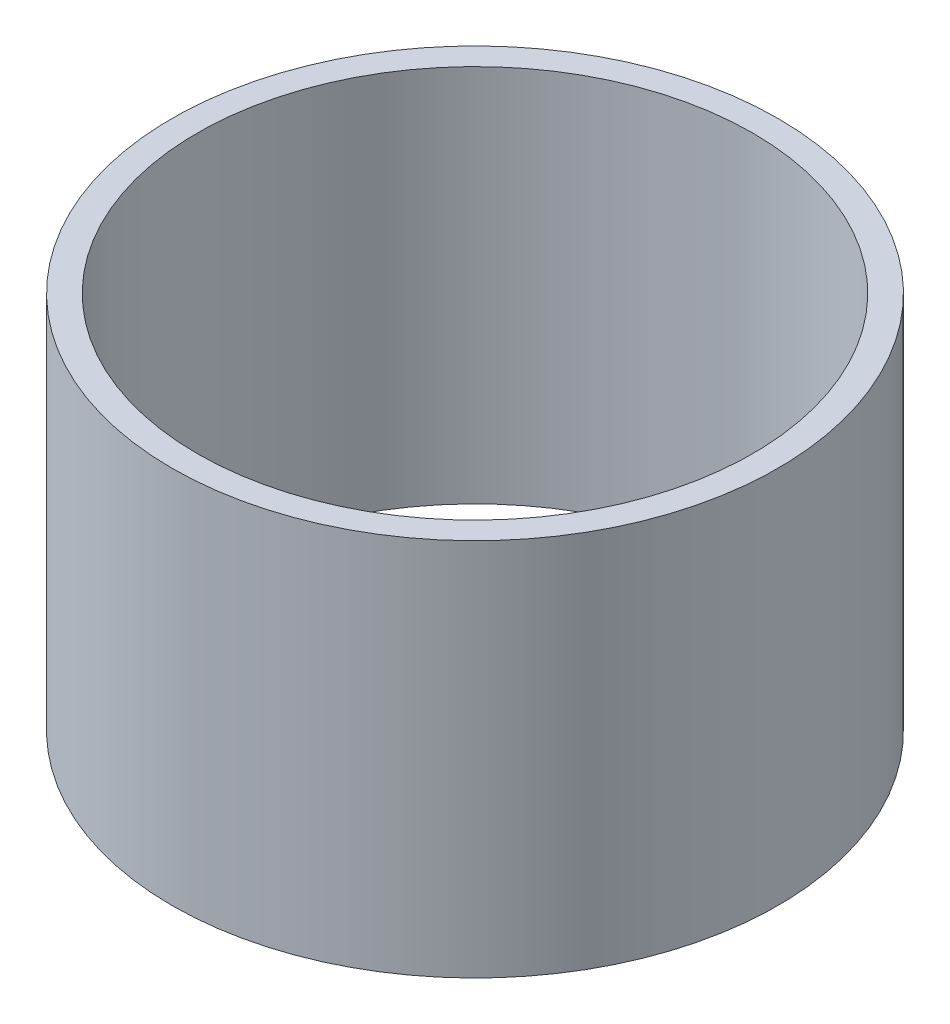
ISO-10303-21;
HEADER;
FILE_DESCRIPTION(('STEP AP214'),'2;1');
FILE_NAME('part.step','',(''),(''),'','','');
FILE_SCHEMA(('AUTOMOTIVE_DESIGN { 1 0 10303 214 1 1 1 1 }'));
ENDSEC;
DATA;
#1=APPLICATION_CONTEXT('core data for automotive mechanical design processes');
#2=APPLICATION_PROTOCOL_DEFINITION('international standard','automotive_design',2000,#1);
#3=PRODUCT_CONTEXT('',#1,'mechanical');
#4=PRODUCT('Part','Part','',(#3));
#5=PRODUCT_RELATED_PRODUCT_CATEGORY('part','',(#4));
#6=PRODUCT_DEFINITION_FORMATION('','',#4);
#7=PRODUCT_DEFINITION_CONTEXT('part definition',#1,'design');
#8=PRODUCT_DEFINITION('design','',#6,#7);
#9=PRODUCT_DEFINITION_SHAPE('','',#8);
#10=(LENGTH_UNIT() NAMED_UNIT(*) SI_UNIT(.MILLI.,.METRE.));
#11=(NAMED_UNIT(*) PLANE_ANGLE_UNIT() SI_UNIT($,.RADIAN.));
#12=(NAMED_UNIT(*) SI_UNIT($,.STERADIAN.) SOLID_ANGLE_UNIT());
#13=UNCERTAINTY_MEASURE_WITH_UNIT(LENGTH_MEASURE(1.E-05),#10,'distance_accuracy_value','');
#14=(GEOMETRIC_REPRESENTATION_CONTEXT(3) GLOBAL_UNCERTAINTY_ASSIGNED_CONTEXT((#13)) GLOBAL_UNIT_ASSIGNED_CONTEXT((#10,
#11,#12)) REPRESENTATION_CONTEXT('',''));
#15=CARTESIAN_POINT('',(0.,0.,0.));
#16=DIRECTION('',(0.,0.,1.));
#17=DIRECTION('',(1.,0.,0.));
#18=AXIS2_PLACEMENT_3D('',#15,#16,#17);
#19=CARTESIAN_POINT('',(0.,7.5,0.));
#20=DIRECTION('',(0.,1.,0.));
#21=DIRECTION('',(0.,0.,1.));
#22=AXIS2_PLACEMENT_3D('',#19,#20,#21);
#23=PLANE('',#22);
#24=CARTESIAN_POINT('',(0.,7.5,0.));
#25=DIRECTION('',(0.,1.,0.));
#26=DIRECTION('',(0.,0.,1.));
#27=AXIS2_PLACEMENT_3D('',#24,#25,#26);
#28=CIRCLE('',#27,6.);
#29=CARTESIAN_POINT('',(0.,7.5,6.));
#30=VERTEX_POINT('',#29);
#31=EDGE_CURVE('E10',#30,#30,#28,.T.);
#32=ORIENTED_EDGE('',*,*,#31,.T.);
#33=EDGE_LOOP('',(#32));
#34=FACE_BOUND('',#33,.T.);
#35=CARTESIAN_POINT('',(0.,7.5,0.));
#36=DIRECTION('',(0.,1.,0.));
#37=DIRECTION('',(0.,0.,1.));
#38=AXIS2_PLACEMENT_3D('',#35,#36,#37);
#39=CIRCLE('',#38,5.5);
#40=CARTESIAN_POINT('',(0.,7.5,5.5));
#41=VERTEX_POINT('',#40);
#42=EDGE_CURVE('E46',#41,#41,#39,.T.);
#43=ORIENTED_EDGE('',*,*,#42,.F.);
#44=EDGE_LOOP('',(#43));
#45=FACE_BOUND('',#44,.T.);
#46=ADVANCED_FACE('F35',(#34,#45),#23,.T.);
#47=CARTESIAN_POINT('',(0.,0.,0.));
#48=DIRECTION('',(0.,1.,0.));
#49=DIRECTION('',(0.,0.,1.));
#50=AXIS2_PLACEMENT_3D('',#47,#48,#49);
#51=PLANE('',#50);
#52=CARTESIAN_POINT('',(0.,0.,0.));
#53=DIRECTION('',(0.,1.,0.));
#54=DIRECTION('',(0.,0.,1.));
#55=AXIS2_PLACEMENT_3D('',#52,#53,#54);
#56=CIRCLE('',#55,6.);
#57=CARTESIAN_POINT('',(0.,0.,6.));
#58=VERTEX_POINT('',#57);
#59=EDGE_CURVE('E39',#58,#58,#56,.T.);
#60=ORIENTED_EDGE('',*,*,#59,.F.);
#61=EDGE_LOOP('',(#60));
#62=FACE_BOUND('',#61,.T.);
#63=CARTESIAN_POINT('',(0.,0.,0.));
#64=DIRECTION('',(0.,1.,0.));
#65=DIRECTION('',(0.,0.,1.));
#66=AXIS2_PLACEMENT_3D('',#63,#64,#65);
#67=CIRCLE('',#66,5.5);
#68=CARTESIAN_POINT('',(0.,0.,5.5));
#69=VERTEX_POINT('',#68);
#70=EDGE_CURVE('E48',#69,#69,#67,.T.);
#71=ORIENTED_EDGE('',*,*,#70,.T.);
#72=EDGE_LOOP('',(#71));
#73=FACE_BOUND('',#72,.T.);
#74=ADVANCED_FACE('F58',(#62,#73),#51,.F.);
#75=CARTESIAN_POINT('',(0.,7.5,0.));
#76=DIRECTION('',(0.,-1.,0.));
#77=DIRECTION('',(0.,0.,-1.));
#78=AXIS2_PLACEMENT_3D('',#75,#76,#77);
#79=CYLINDRICAL_SURFACE('',#78,6.);
#80=ORIENTED_EDGE('',*,*,#31,.F.);
#81=EDGE_LOOP('',(#80));
#82=FACE_BOUND('',#81,.T.);
#83=ORIENTED_EDGE('',*,*,#59,.T.);
#84=EDGE_LOOP('',(#83));
#85=FACE_BOUND('',#84,.T.);
#86=ADVANCED_FACE('F37',(#82,#85),#79,.T.);
#87=CARTESIAN_POINT('',(0.,7.5,0.));
#88=DIRECTION('',(0.,-1.,0.));
#89=DIRECTION('',(0.,0.,-1.));
#90=AXIS2_PLACEMENT_3D('',#87,#88,#89);
#91=CYLINDRICAL_SURFACE('',#90,5.5);
#92=ORIENTED_EDGE('',*,*,#42,.T.);
#93=EDGE_LOOP('',(#92));
#94=FACE_BOUND('',#93,.T.);
#95=ORIENTED_EDGE('',*,*,#70,.F.);
#96=EDGE_LOOP('',(#95));
#97=FACE_BOUND('',#96,.T.);
#98=ADVANCED_FACE('F54',(#94,#97),#91,.F.);
#99=CLOSED_SHELL('',(#46,#74,#86,#98));
#100=MANIFOLD_SOLID_BREP('B2',#99);
#101=ADVANCED_BREP_SHAPE_REPRESENTATION('',(#18,#100),#14);
#102=SHAPE_DEFINITION_REPRESENTATION(#9,#101);
ENDSEC;
END-ISO-10303-21;
